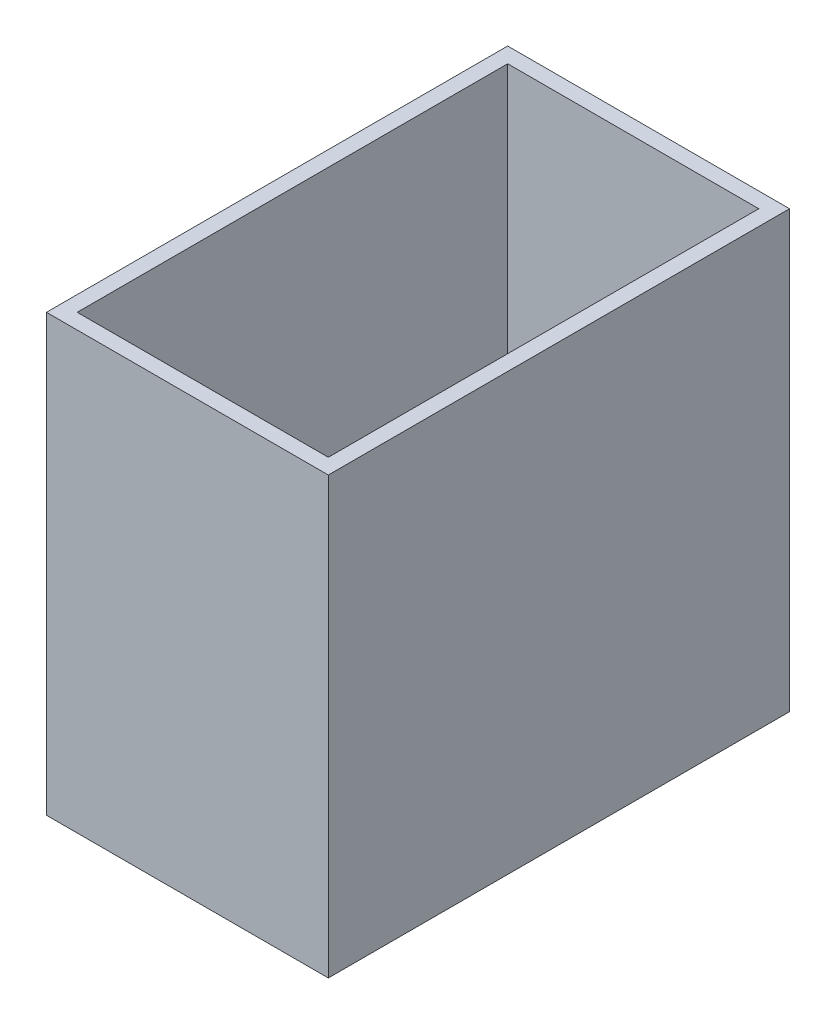
ISO-10303-21;
HEADER;
FILE_DESCRIPTION(('STEP AP214'),'2;1');
FILE_NAME('part.step','',(''),(''),'','','');
FILE_SCHEMA(('AUTOMOTIVE_DESIGN { 1 0 10303 214 1 1 1 1 }'));
ENDSEC;
DATA;
#1=APPLICATION_CONTEXT('core data for automotive mechanical design processes');
#2=APPLICATION_PROTOCOL_DEFINITION('international standard','automotive_design',2000,#1);
#3=PRODUCT_CONTEXT('',#1,'mechanical');
#4=PRODUCT('Part','Part','',(#3));
#5=PRODUCT_RELATED_PRODUCT_CATEGORY('part','',(#4));
#6=PRODUCT_DEFINITION_FORMATION('','',#4);
#7=PRODUCT_DEFINITION_CONTEXT('part definition',#1,'design');
#8=PRODUCT_DEFINITION('design','',#6,#7);
#9=PRODUCT_DEFINITION_SHAPE('','',#8);
#10=(LENGTH_UNIT() NAMED_UNIT(*) SI_UNIT(.MILLI.,.METRE.));
#11=(NAMED_UNIT(*) PLANE_ANGLE_UNIT() SI_UNIT($,.RADIAN.));
#12=(NAMED_UNIT(*) SI_UNIT($,.STERADIAN.) SOLID_ANGLE_UNIT());
#13=UNCERTAINTY_MEASURE_WITH_UNIT(LENGTH_MEASURE(1.E-05),#10,'distance_accuracy_value','');
#14=(GEOMETRIC_REPRESENTATION_CONTEXT(3) GLOBAL_UNCERTAINTY_ASSIGNED_CONTEXT((#13)) GLOBAL_UNIT_ASSIGNED_CONTEXT((#10,
#11,#12)) REPRESENTATION_CONTEXT('',''));
#15=CARTESIAN_POINT('',(0.,0.,0.));
#16=DIRECTION('',(0.,0.,1.));
#17=DIRECTION('',(1.,0.,0.));
#18=AXIS2_PLACEMENT_3D('',#15,#16,#17);
#19=CARTESIAN_POINT('',(-24.5,36.,-87.2769256906871));
#20=DIRECTION('',(0.728848072093987,0.684675461664049,0.));
#21=DIRECTION('',(-0.684675461664049,0.728848072093987,0.));
#22=AXIS2_PLACEMENT_3D('',#19,#20,#21);
#23=PLANE('',#22);
#24=DIRECTION('',(0.547494719493018,-0.58281695946031,0.600478079443955));
#25=VECTOR('',#24,1.);
#26=CARTESIAN_POINT('',(-39.385177691199,51.8455117357925,-58.3256787580893));
#27=LINE('',#26,#25);
#28=CARTESIAN_POINT('',(-24.5,36.,-42.));
#29=VERTEX_POINT('',#28);
#30=CARTESIAN_POINT('',(6.50000000000001,3.00000000000001,-8.));
#31=VERTEX_POINT('',#30);
#32=EDGE_CURVE('E152',#29,#31,#27,.T.);
#33=ORIENTED_EDGE('',*,*,#32,.F.);
#34=DIRECTION('',(0.,0.,1.));
#35=VECTOR('',#34,1.);
#36=CARTESIAN_POINT('',(-24.5,36.,-87.2769256906871));
#37=LINE('',#36,#35);
#38=CARTESIAN_POINT('',(-24.5,36.,-8.));
#39=VERTEX_POINT('',#38);
#40=EDGE_CURVE('E144',#29,#39,#37,.T.);
#41=ORIENTED_EDGE('',*,*,#40,.T.);
#42=DIRECTION('',(-0.684675461664049,0.728848072093987,0.));
#43=VECTOR('',#42,1.);
#44=CARTESIAN_POINT('',(-24.5,36.,-7.99999999999999));
#45=LINE('',#44,#43);
#46=EDGE_CURVE('E11',#31,#39,#45,.T.);
#47=ORIENTED_EDGE('',*,*,#46,.F.);
#48=EDGE_LOOP('',(#33,#41,#47));
#49=FACE_BOUND('',#48,.T.);
#50=ADVANCED_FACE('F33',(#49),#23,.T.);
#51=CARTESIAN_POINT('',(-27.5,85.,45.));
#52=DIRECTION('',(1.,0.,0.));
#53=DIRECTION('',(0.,0.,-1.));
#54=AXIS2_PLACEMENT_3D('',#51,#52,#53);
#55=PLANE('',#54);
#56=DIRECTION('',(0.,0.,1.));
#57=VECTOR('',#56,1.);
#58=CARTESIAN_POINT('',(-27.5,0.,45.));
#59=LINE('',#58,#57);
#60=CARTESIAN_POINT('',(-27.5,0.,-45.));
#61=VERTEX_POINT('',#60);
#62=CARTESIAN_POINT('',(-27.5,0.,-8.));
#63=VERTEX_POINT('',#62);
#64=EDGE_CURVE('E225',#61,#63,#59,.T.);
#65=ORIENTED_EDGE('',*,*,#64,.T.);
#66=DIRECTION('',(0.,-1.,0.));
#67=VECTOR('',#66,1.);
#68=CARTESIAN_POINT('',(-27.5,-36.,-8.));
#69=LINE('',#68,#67);
#70=CARTESIAN_POINT('',(-27.5,36.,-8.));
#71=VERTEX_POINT('',#70);
#72=EDGE_CURVE('E168',#71,#63,#69,.T.);
#73=ORIENTED_EDGE('',*,*,#72,.F.);
#74=DIRECTION('',(0.,0.,-1.));
#75=VECTOR('',#74,1.);
#76=CARTESIAN_POINT('',(-27.5,36.,8.));
#77=LINE('',#76,#75);
#78=CARTESIAN_POINT('',(-27.5,36.,8.));
#79=VERTEX_POINT('',#78);
#80=EDGE_CURVE('E172',#79,#71,#77,.T.);
#81=ORIENTED_EDGE('',*,*,#80,.F.);
#82=DIRECTION('',(0.,1.,0.));
#83=VECTOR('',#82,1.);
#84=CARTESIAN_POINT('',(-27.5,-36.,8.));
#85=LINE('',#84,#83);
#86=CARTESIAN_POINT('',(-27.5,0.,8.));
#87=VERTEX_POINT('',#86);
#88=EDGE_CURVE('E177',#87,#79,#85,.T.);
#89=ORIENTED_EDGE('',*,*,#88,.F.);
#90=CARTESIAN_POINT('',(-27.5,0.,45.));
#91=VERTEX_POINT('',#90);
#92=EDGE_CURVE('E201',#87,#91,#59,.T.);
#93=ORIENTED_EDGE('',*,*,#92,.T.);
#94=DIRECTION('',(0.,-1.,0.));
#95=VECTOR('',#94,1.);
#96=CARTESIAN_POINT('',(-27.5,85.,45.));
#97=LINE('',#96,#95);
#98=CARTESIAN_POINT('',(-27.5,85.,45.));
#99=VERTEX_POINT('',#98);
#100=EDGE_CURVE('E241',#99,#91,#97,.T.);
#101=ORIENTED_EDGE('',*,*,#100,.F.);
#102=DIRECTION('',(0.,0.,1.));
#103=VECTOR('',#102,1.);
#104=CARTESIAN_POINT('',(-27.5,85.,45.));
#105=LINE('',#104,#103);
#106=CARTESIAN_POINT('',(-27.5,85.,-45.));
#107=VERTEX_POINT('',#106);
#108=EDGE_CURVE('E214',#107,#99,#105,.T.);
#109=ORIENTED_EDGE('',*,*,#108,.F.);
#110=DIRECTION('',(0.,-1.,0.));
#111=VECTOR('',#110,1.);
#112=CARTESIAN_POINT('',(-27.5,85.,-45.));
#113=LINE('',#112,#111);
#114=EDGE_CURVE('E224',#107,#61,#113,.T.);
#115=ORIENTED_EDGE('',*,*,#114,.T.);
#116=EDGE_LOOP('',(#65,#73,#81,#89,#93,#101,#109,#115));
#117=FACE_BOUND('',#116,.T.);
#118=ADVANCED_FACE('F35',(#117),#55,.F.);
#119=CARTESIAN_POINT('',(27.5,85.,45.));
#120=DIRECTION('',(0.,0.,-1.));
#121=DIRECTION('',(-1.,0.,0.));
#122=AXIS2_PLACEMENT_3D('',#119,#120,#121);
#123=PLANE('',#122);
#124=DIRECTION('',(1.,0.,0.));
#125=VECTOR('',#124,1.);
#126=CARTESIAN_POINT('',(27.5,0.,45.));
#127=LINE('',#126,#125);
#128=CARTESIAN_POINT('',(27.5,0.,45.));
#129=VERTEX_POINT('',#128);
#130=EDGE_CURVE('E228',#91,#129,#127,.T.);
#131=ORIENTED_EDGE('',*,*,#130,.T.);
#132=DIRECTION('',(0.,-1.,0.));
#133=VECTOR('',#132,1.);
#134=CARTESIAN_POINT('',(27.5,85.,45.));
#135=LINE('',#134,#133);
#136=CARTESIAN_POINT('',(27.5,85.,45.));
#137=VERTEX_POINT('',#136);
#138=EDGE_CURVE('E238',#137,#129,#135,.T.);
#139=ORIENTED_EDGE('',*,*,#138,.F.);
#140=DIRECTION('',(1.,0.,0.));
#141=VECTOR('',#140,1.);
#142=CARTESIAN_POINT('',(27.5,85.,45.));
#143=LINE('',#142,#141);
#144=EDGE_CURVE('E217',#99,#137,#143,.T.);
#145=ORIENTED_EDGE('',*,*,#144,.F.);
#146=ORIENTED_EDGE('',*,*,#100,.T.);
#147=EDGE_LOOP('',(#131,#139,#145,#146));
#148=FACE_BOUND('',#147,.T.);
#149=ADVANCED_FACE('F307',(#148),#123,.F.);
#150=CARTESIAN_POINT('',(27.5,85.,45.));
#151=DIRECTION('',(-1.,0.,0.));
#152=DIRECTION('',(0.,0.,1.));
#153=AXIS2_PLACEMENT_3D('',#150,#151,#152);
#154=PLANE('',#153);
#155=DIRECTION('',(0.,0.,-1.));
#156=VECTOR('',#155,1.);
#157=CARTESIAN_POINT('',(27.5,0.,45.));
#158=LINE('',#157,#156);
#159=CARTESIAN_POINT('',(27.5,0.,-45.));
#160=VERTEX_POINT('',#159);
#161=EDGE_CURVE('E230',#129,#160,#158,.T.);
#162=ORIENTED_EDGE('',*,*,#161,.T.);
#163=DIRECTION('',(0.,-1.,0.));
#164=VECTOR('',#163,1.);
#165=CARTESIAN_POINT('',(27.5,85.,-45.));
#166=LINE('',#165,#164);
#167=CARTESIAN_POINT('',(27.5,85.,-45.));
#168=VERTEX_POINT('',#167);
#169=EDGE_CURVE('E235',#168,#160,#166,.T.);
#170=ORIENTED_EDGE('',*,*,#169,.F.);
#171=DIRECTION('',(0.,0.,-1.));
#172=VECTOR('',#171,1.);
#173=CARTESIAN_POINT('',(27.5,85.,45.));
#174=LINE('',#173,#172);
#175=EDGE_CURVE('E220',#137,#168,#174,.T.);
#176=ORIENTED_EDGE('',*,*,#175,.F.);
#177=ORIENTED_EDGE('',*,*,#138,.T.);
#178=EDGE_LOOP('',(#162,#170,#176,#177));
#179=FACE_BOUND('',#178,.T.);
#180=ADVANCED_FACE('F329',(#179),#154,.F.);
#181=CARTESIAN_POINT('',(27.5,85.,-45.));
#182=DIRECTION('',(0.,0.,1.));
#183=DIRECTION('',(1.,0.,0.));
#184=AXIS2_PLACEMENT_3D('',#181,#182,#183);
#185=PLANE('',#184);
#186=DIRECTION('',(-1.,0.,0.));
#187=VECTOR('',#186,1.);
#188=CARTESIAN_POINT('',(27.5,0.,-45.));
#189=LINE('',#188,#187);
#190=EDGE_CURVE('E218',#160,#61,#189,.T.);
#191=ORIENTED_EDGE('',*,*,#190,.T.);
#192=ORIENTED_EDGE('',*,*,#114,.F.);
#193=DIRECTION('',(-1.,0.,0.));
#194=VECTOR('',#193,1.);
#195=CARTESIAN_POINT('',(27.5,85.,-45.));
#196=LINE('',#195,#194);
#197=EDGE_CURVE('E222',#168,#107,#196,.T.);
#198=ORIENTED_EDGE('',*,*,#197,.F.);
#199=ORIENTED_EDGE('',*,*,#169,.T.);
#200=EDGE_LOOP('',(#191,#192,#198,#199));
#201=FACE_BOUND('',#200,.T.);
#202=ADVANCED_FACE('F324',(#201),#185,.F.);
#203=CARTESIAN_POINT('',(0.,85.,0.));
#204=DIRECTION('',(0.,1.,0.));
#205=DIRECTION('',(0.,0.,1.));
#206=AXIS2_PLACEMENT_3D('',#203,#204,#205);
#207=PLANE('',#206);
#208=DIRECTION('',(0.,0.,1.));
#209=VECTOR('',#208,1.);
#210=CARTESIAN_POINT('',(-24.5,85.,45.));
#211=LINE('',#210,#209);
#212=CARTESIAN_POINT('',(-24.5,85.,-42.));
#213=VERTEX_POINT('',#212);
#214=CARTESIAN_POINT('',(-24.5,85.,42.));
#215=VERTEX_POINT('',#214);
#216=EDGE_CURVE('E143',#213,#215,#211,.T.);
#217=ORIENTED_EDGE('',*,*,#216,.F.);
#218=DIRECTION('',(-1.,0.,0.));
#219=VECTOR('',#218,1.);
#220=CARTESIAN_POINT('',(27.5,85.,-42.));
#221=LINE('',#220,#219);
#222=CARTESIAN_POINT('',(24.5,85.,-42.));
#223=VERTEX_POINT('',#222);
#224=EDGE_CURVE('E205',#223,#213,#221,.T.);
#225=ORIENTED_EDGE('',*,*,#224,.F.);
#226=DIRECTION('',(0.,0.,-1.));
#227=VECTOR('',#226,1.);
#228=CARTESIAN_POINT('',(24.5,85.,45.));
#229=LINE('',#228,#227);
#230=CARTESIAN_POINT('',(24.5,85.,42.));
#231=VERTEX_POINT('',#230);
#232=EDGE_CURVE('E211',#231,#223,#229,.T.);
#233=ORIENTED_EDGE('',*,*,#232,.F.);
#234=DIRECTION('',(1.,0.,0.));
#235=VECTOR('',#234,1.);
#236=CARTESIAN_POINT('',(27.5,85.,42.));
#237=LINE('',#236,#235);
#238=EDGE_CURVE('E209',#215,#231,#237,.T.);
#239=ORIENTED_EDGE('',*,*,#238,.F.);
#240=EDGE_LOOP('',(#217,#225,#233,#239));
#241=FACE_BOUND('',#240,.T.);
#242=ORIENTED_EDGE('',*,*,#108,.T.);
#243=ORIENTED_EDGE('',*,*,#144,.T.);
#244=ORIENTED_EDGE('',*,*,#175,.T.);
#245=ORIENTED_EDGE('',*,*,#197,.T.);
#246=EDGE_LOOP('',(#242,#243,#244,#245));
#247=FACE_BOUND('',#246,.T.);
#248=ADVANCED_FACE('F265',(#241,#247),#207,.T.);
#249=CARTESIAN_POINT('',(0.,0.,0.));
#250=DIRECTION('',(0.,1.,0.));
#251=DIRECTION('',(0.,0.,1.));
#252=AXIS2_PLACEMENT_3D('',#249,#250,#251);
#253=PLANE('',#252);
#254=DIRECTION('',(0.,0.,1.));
#255=VECTOR('',#254,1.);
#256=CARTESIAN_POINT('',(6.50000000000001,0.,0.));
#257=LINE('',#256,#255);
#258=CARTESIAN_POINT('',(6.50000000000001,0.,-8.));
#259=VERTEX_POINT('',#258);
#260=CARTESIAN_POINT('',(6.50000000000001,0.,8.));
#261=VERTEX_POINT('',#260);
#262=EDGE_CURVE('E184',#259,#261,#257,.T.);
#263=ORIENTED_EDGE('',*,*,#262,.F.);
#264=DIRECTION('',(-1.,0.,0.));
#265=VECTOR('',#264,1.);
#266=CARTESIAN_POINT('',(0.,0.,-8.));
#267=LINE('',#266,#265);
#268=EDGE_CURVE('E190',#259,#63,#267,.T.);
#269=ORIENTED_EDGE('',*,*,#268,.T.);
#270=ORIENTED_EDGE('',*,*,#64,.F.);
#271=ORIENTED_EDGE('',*,*,#190,.F.);
#272=ORIENTED_EDGE('',*,*,#161,.F.);
#273=ORIENTED_EDGE('',*,*,#130,.F.);
#274=ORIENTED_EDGE('',*,*,#92,.F.);
#275=DIRECTION('',(1.,0.,0.));
#276=VECTOR('',#275,1.);
#277=CARTESIAN_POINT('',(0.,0.,8.));
#278=LINE('',#277,#276);
#279=EDGE_CURVE('E187',#87,#261,#278,.T.);
#280=ORIENTED_EDGE('',*,*,#279,.T.);
#281=EDGE_LOOP('',(#263,#269,#270,#271,#272,#273,#274,#280));
#282=FACE_BOUND('',#281,.T.);
#283=ADVANCED_FACE('F288',(#282),#253,.F.);
#284=CARTESIAN_POINT('',(-24.5,85.,45.));
#285=DIRECTION('',(1.,0.,0.));
#286=DIRECTION('',(0.,0.,-1.));
#287=AXIS2_PLACEMENT_3D('',#284,#285,#286);
#288=PLANE('',#287);
#289=ORIENTED_EDGE('',*,*,#40,.F.);
#290=DIRECTION('',(0.,-1.,0.));
#291=VECTOR('',#290,1.);
#292=CARTESIAN_POINT('',(-24.5,85.,-42.));
#293=LINE('',#292,#291);
#294=EDGE_CURVE('E203',#213,#29,#293,.T.);
#295=ORIENTED_EDGE('',*,*,#294,.F.);
#296=ORIENTED_EDGE('',*,*,#216,.T.);
#297=DIRECTION('',(0.,-1.,0.));
#298=VECTOR('',#297,1.);
#299=CARTESIAN_POINT('',(-24.5,85.,42.));
#300=LINE('',#299,#298);
#301=CARTESIAN_POINT('',(-24.5,36.,42.));
#302=VERTEX_POINT('',#301);
#303=EDGE_CURVE('E199',#215,#302,#300,.T.);
#304=ORIENTED_EDGE('',*,*,#303,.T.);
#305=CARTESIAN_POINT('',(-24.5,36.,8.00000000000001));
#306=VERTEX_POINT('',#305);
#307=EDGE_CURVE('E197',#306,#302,#37,.T.);
#308=ORIENTED_EDGE('',*,*,#307,.F.);
#309=EDGE_CURVE('E196',#39,#306,#37,.T.);
#310=ORIENTED_EDGE('',*,*,#309,.F.);
#311=EDGE_LOOP('',(#289,#295,#296,#304,#308,#310));
#312=FACE_BOUND('',#311,.T.);
#313=ADVANCED_FACE('F271',(#312),#288,.T.);
#314=CARTESIAN_POINT('',(27.5,85.,42.));
#315=DIRECTION('',(0.,0.,-1.));
#316=DIRECTION('',(-1.,0.,0.));
#317=AXIS2_PLACEMENT_3D('',#314,#315,#316);
#318=PLANE('',#317);
#319=DIRECTION('',(1.,0.,0.));
#320=VECTOR('',#319,1.);
#321=CARTESIAN_POINT('',(-24.9,36.,42.));
#322=LINE('',#321,#320);
#323=CARTESIAN_POINT('',(24.5,36.,42.));
#324=VERTEX_POINT('',#323);
#325=EDGE_CURVE('E160',#302,#324,#322,.T.);
#326=ORIENTED_EDGE('',*,*,#325,.F.);
#327=ORIENTED_EDGE('',*,*,#303,.F.);
#328=ORIENTED_EDGE('',*,*,#238,.T.);
#329=DIRECTION('',(0.,-1.,0.));
#330=VECTOR('',#329,1.);
#331=CARTESIAN_POINT('',(24.5,85.,42.));
#332=LINE('',#331,#330);
#333=EDGE_CURVE('E202',#231,#324,#332,.T.);
#334=ORIENTED_EDGE('',*,*,#333,.T.);
#335=EDGE_LOOP('',(#326,#327,#328,#334));
#336=FACE_BOUND('',#335,.T.);
#337=ADVANCED_FACE('F259',(#336),#318,.T.);
#338=CARTESIAN_POINT('',(24.5,85.,45.));
#339=DIRECTION('',(-1.,0.,0.));
#340=DIRECTION('',(0.,0.,1.));
#341=AXIS2_PLACEMENT_3D('',#338,#339,#340);
#342=PLANE('',#341);
#343=DIRECTION('',(0.,0.69647537716866,-0.717580691628316));
#344=VECTOR('',#343,1.);
#345=CARTESIAN_POINT('',(24.5,16.2881959910913,-21.690868596882));
#346=LINE('',#345,#344);
#347=CARTESIAN_POINT('',(24.5,3.,-7.99999999999999));
#348=VERTEX_POINT('',#347);
#349=CARTESIAN_POINT('',(24.5,36.,-42.));
#350=VERTEX_POINT('',#349);
#351=EDGE_CURVE('E147',#348,#350,#346,.T.);
#352=ORIENTED_EDGE('',*,*,#351,.F.);
#353=DIRECTION('',(0.,0.,-1.));
#354=VECTOR('',#353,1.);
#355=CARTESIAN_POINT('',(24.5,3.,45.));
#356=LINE('',#355,#354);
#357=CARTESIAN_POINT('',(24.5,3.,8.00000000000001));
#358=VERTEX_POINT('',#357);
#359=EDGE_CURVE('E134',#358,#348,#356,.T.);
#360=ORIENTED_EDGE('',*,*,#359,.F.);
#361=DIRECTION('',(0.,-0.69647537716866,-0.717580691628316));
#362=VECTOR('',#361,1.);
#363=CARTESIAN_POINT('',(24.5,61.2681514476615,68.0338530066815));
#364=LINE('',#363,#362);
#365=EDGE_CURVE('E56',#324,#358,#364,.T.);
#366=ORIENTED_EDGE('',*,*,#365,.F.);
#367=ORIENTED_EDGE('',*,*,#333,.F.);
#368=ORIENTED_EDGE('',*,*,#232,.T.);
#369=DIRECTION('',(0.,-1.,0.));
#370=VECTOR('',#369,1.);
#371=CARTESIAN_POINT('',(24.5,85.,-42.));
#372=LINE('',#371,#370);
#373=EDGE_CURVE('E150',#223,#350,#372,.T.);
#374=ORIENTED_EDGE('',*,*,#373,.T.);
#375=EDGE_LOOP('',(#352,#360,#366,#367,#368,#374));
#376=FACE_BOUND('',#375,.T.);
#377=ADVANCED_FACE('F148',(#376),#342,.T.);
#378=CARTESIAN_POINT('',(27.5,85.,-42.));
#379=DIRECTION('',(0.,0.,1.));
#380=DIRECTION('',(1.,0.,0.));
#381=AXIS2_PLACEMENT_3D('',#378,#379,#380);
#382=PLANE('',#381);
#383=DIRECTION('',(1.,0.,0.));
#384=VECTOR('',#383,1.);
#385=CARTESIAN_POINT('',(-24.9,36.,-42.));
#386=LINE('',#385,#384);
#387=EDGE_CURVE('E48',#29,#350,#386,.T.);
#388=ORIENTED_EDGE('',*,*,#387,.T.);
#389=ORIENTED_EDGE('',*,*,#373,.F.);
#390=ORIENTED_EDGE('',*,*,#224,.T.);
#391=ORIENTED_EDGE('',*,*,#294,.T.);
#392=EDGE_LOOP('',(#388,#389,#390,#391));
#393=FACE_BOUND('',#392,.T.);
#394=ADVANCED_FACE('F268',(#393),#382,.T.);
#395=CARTESIAN_POINT('',(0.,3.,0.));
#396=DIRECTION('',(0.,1.,0.));
#397=DIRECTION('',(0.,0.,1.));
#398=AXIS2_PLACEMENT_3D('',#395,#396,#397);
#399=PLANE('',#398);
#400=DIRECTION('',(1.,0.,0.));
#401=VECTOR('',#400,1.);
#402=CARTESIAN_POINT('',(-24.9,3.,-8.));
#403=LINE('',#402,#401);
#404=EDGE_CURVE('E139',#31,#348,#403,.T.);
#405=ORIENTED_EDGE('',*,*,#404,.F.);
#406=DIRECTION('',(0.,0.,1.));
#407=VECTOR('',#406,1.);
#408=CARTESIAN_POINT('',(6.50000000000001,3.,-87.2769256906871));
#409=LINE('',#408,#407);
#410=CARTESIAN_POINT('',(6.50000000000001,3.,8.00000000000001));
#411=VERTEX_POINT('',#410);
#412=EDGE_CURVE('E193',#31,#411,#409,.T.);
#413=ORIENTED_EDGE('',*,*,#412,.T.);
#414=DIRECTION('',(1.,0.,0.));
#415=VECTOR('',#414,1.);
#416=CARTESIAN_POINT('',(-24.9,3.,8.));
#417=LINE('',#416,#415);
#418=EDGE_CURVE('E142',#411,#358,#417,.T.);
#419=ORIENTED_EDGE('',*,*,#418,.T.);
#420=ORIENTED_EDGE('',*,*,#359,.T.);
#421=EDGE_LOOP('',(#405,#413,#419,#420));
#422=FACE_BOUND('',#421,.T.);
#423=ADVANCED_FACE('F136',(#422),#399,.T.);
#424=DIRECTION('',(-0.547494719493018,0.58281695946031,0.600478079443955));
#425=VECTOR('',#424,1.);
#426=CARTESIAN_POINT('',(18.0008982152165,-9.2428916484563,-4.61388836507617));
#427=LINE('',#426,#425);
#428=EDGE_CURVE('E162',#411,#302,#427,.T.);
#429=ORIENTED_EDGE('',*,*,#428,.F.);
#430=DIRECTION('',(0.684675461664049,-0.728848072093987,0.));
#431=VECTOR('',#430,1.);
#432=CARTESIAN_POINT('',(-24.5,36.,8.00000000000001));
#433=LINE('',#432,#431);
#434=EDGE_CURVE('E41',#306,#411,#433,.T.);
#435=ORIENTED_EDGE('',*,*,#434,.F.);
#436=ORIENTED_EDGE('',*,*,#307,.T.);
#437=EDGE_LOOP('',(#429,#435,#436));
#438=FACE_BOUND('',#437,.T.);
#439=ADVANCED_FACE('F303',(#438),#23,.T.);
#440=CARTESIAN_POINT('',(6.50000000000001,-36.,-8.));
#441=DIRECTION('',(0.,0.,-1.));
#442=DIRECTION('',(-1.,0.,0.));
#443=AXIS2_PLACEMENT_3D('',#440,#441,#442);
#444=PLANE('',#443);
#445=DIRECTION('',(0.,-1.,0.));
#446=VECTOR('',#445,1.);
#447=CARTESIAN_POINT('',(6.50000000000001,-36.,-8.));
#448=LINE('',#447,#446);
#449=EDGE_CURVE('E169',#31,#259,#448,.T.);
#450=ORIENTED_EDGE('',*,*,#449,.F.);
#451=ORIENTED_EDGE('',*,*,#46,.T.);
#452=DIRECTION('',(-1.,0.,0.));
#453=VECTOR('',#452,1.);
#454=CARTESIAN_POINT('',(6.50000000000001,36.,-8.));
#455=LINE('',#454,#453);
#456=EDGE_CURVE('E182',#39,#71,#455,.T.);
#457=ORIENTED_EDGE('',*,*,#456,.T.);
#458=ORIENTED_EDGE('',*,*,#72,.T.);
#459=ORIENTED_EDGE('',*,*,#268,.F.);
#460=EDGE_LOOP('',(#450,#451,#457,#458,#459));
#461=FACE_BOUND('',#460,.T.);
#462=ADVANCED_FACE('F277',(#461),#444,.F.);
#463=CARTESIAN_POINT('',(6.50000000000001,-36.,8.));
#464=DIRECTION('',(0.,0.,1.));
#465=DIRECTION('',(1.,0.,0.));
#466=AXIS2_PLACEMENT_3D('',#463,#464,#465);
#467=PLANE('',#466);
#468=ORIENTED_EDGE('',*,*,#434,.T.);
#469=DIRECTION('',(0.,1.,0.));
#470=VECTOR('',#469,1.);
#471=CARTESIAN_POINT('',(6.50000000000001,-36.,8.));
#472=LINE('',#471,#470);
#473=EDGE_CURVE('E171',#261,#411,#472,.T.);
#474=ORIENTED_EDGE('',*,*,#473,.F.);
#475=ORIENTED_EDGE('',*,*,#279,.F.);
#476=ORIENTED_EDGE('',*,*,#88,.T.);
#477=DIRECTION('',(-1.,0.,0.));
#478=VECTOR('',#477,1.);
#479=CARTESIAN_POINT('',(6.50000000000001,36.,8.));
#480=LINE('',#479,#478);
#481=EDGE_CURVE('E175',#306,#79,#480,.T.);
#482=ORIENTED_EDGE('',*,*,#481,.F.);
#483=EDGE_LOOP('',(#468,#474,#475,#476,#482));
#484=FACE_BOUND('',#483,.T.);
#485=ADVANCED_FACE('F248',(#484),#467,.F.);
#486=CARTESIAN_POINT('',(6.50000000000001,0.,0.));
#487=DIRECTION('',(-1.,0.,0.));
#488=DIRECTION('',(0.,0.,1.));
#489=AXIS2_PLACEMENT_3D('',#486,#487,#488);
#490=PLANE('',#489);
#491=ORIENTED_EDGE('',*,*,#262,.T.);
#492=ORIENTED_EDGE('',*,*,#473,.T.);
#493=ORIENTED_EDGE('',*,*,#412,.F.);
#494=ORIENTED_EDGE('',*,*,#449,.T.);
#495=EDGE_LOOP('',(#491,#492,#493,#494));
#496=FACE_BOUND('',#495,.T.);
#497=ADVANCED_FACE('F291',(#496),#490,.T.);
#498=CARTESIAN_POINT('',(6.50000000000001,36.,8.));
#499=DIRECTION('',(0.,1.,0.));
#500=DIRECTION('',(0.,0.,1.));
#501=AXIS2_PLACEMENT_3D('',#498,#499,#500);
#502=PLANE('',#501);
#503=ORIENTED_EDGE('',*,*,#309,.T.);
#504=ORIENTED_EDGE('',*,*,#481,.T.);
#505=ORIENTED_EDGE('',*,*,#80,.T.);
#506=ORIENTED_EDGE('',*,*,#456,.F.);
#507=EDGE_LOOP('',(#503,#504,#505,#506));
#508=FACE_BOUND('',#507,.T.);
#509=ADVANCED_FACE('F280',(#508),#502,.F.);
#510=CARTESIAN_POINT('',(-24.9,3.,8.));
#511=DIRECTION('',(0.,0.717580691628316,-0.69647537716866));
#512=DIRECTION('',(0.,0.69647537716866,0.717580691628316));
#513=AXIS2_PLACEMENT_3D('',#510,#511,#512);
#514=PLANE('',#513);
#515=ORIENTED_EDGE('',*,*,#325,.T.);
#516=ORIENTED_EDGE('',*,*,#365,.T.);
#517=ORIENTED_EDGE('',*,*,#418,.F.);
#518=ORIENTED_EDGE('',*,*,#428,.T.);
#519=EDGE_LOOP('',(#515,#516,#517,#518));
#520=FACE_BOUND('',#519,.T.);
#521=ADVANCED_FACE('F255',(#520),#514,.T.);
#522=CARTESIAN_POINT('',(-24.9,36.,-42.));
#523=DIRECTION('',(0.,0.717580691628316,0.69647537716866));
#524=DIRECTION('',(0.,-0.69647537716866,0.717580691628316));
#525=AXIS2_PLACEMENT_3D('',#522,#523,#524);
#526=PLANE('',#525);
#527=ORIENTED_EDGE('',*,*,#387,.F.);
#528=ORIENTED_EDGE('',*,*,#32,.T.);
#529=ORIENTED_EDGE('',*,*,#404,.T.);
#530=ORIENTED_EDGE('',*,*,#351,.T.);
#531=EDGE_LOOP('',(#527,#528,#529,#530));
#532=FACE_BOUND('',#531,.T.);
#533=ADVANCED_FACE('F155',(#532),#526,.T.);
#534=CLOSED_SHELL('',(#50,#118,#149,#180,#202,#248,#283,#313,#337,#377,#394,#423,#439,#462,#485,
#497,#509,#521,#533));
#535=MANIFOLD_SOLID_BREP('B2',#534);
#536=ADVANCED_BREP_SHAPE_REPRESENTATION('',(#18,#535),#14);
#537=SHAPE_DEFINITION_REPRESENTATION(#9,#536);
ENDSEC;
END-ISO-10303-21;
